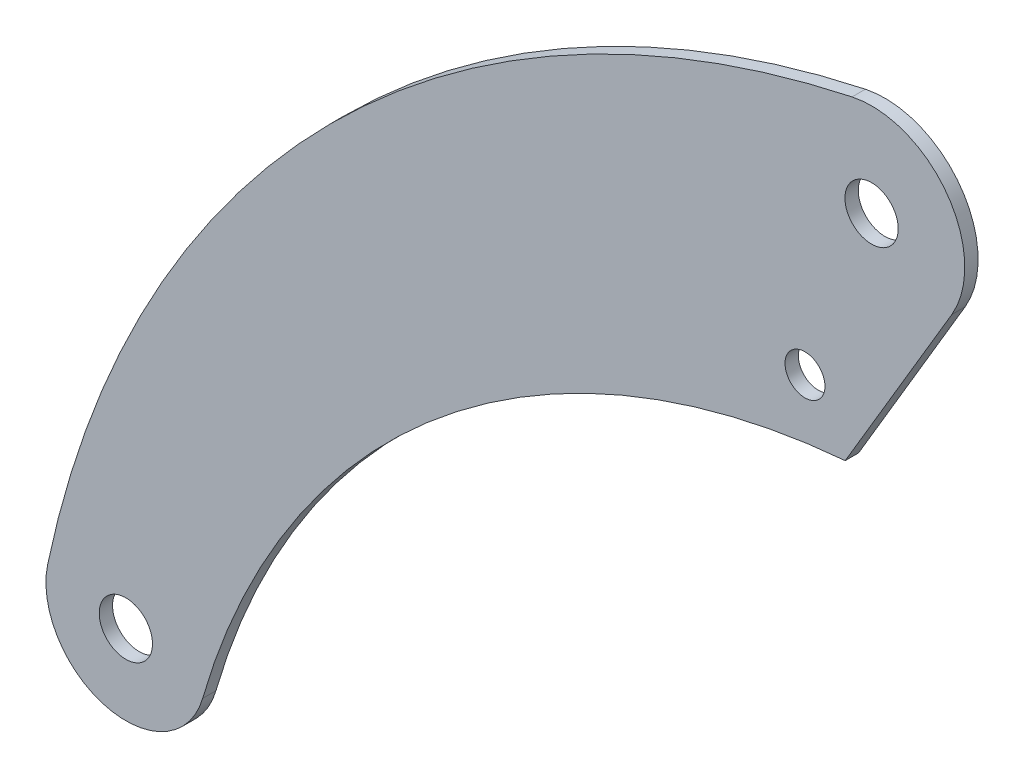
ISO-10303-21;
HEADER;
FILE_DESCRIPTION(('STEP AP214'),'2;1');
FILE_NAME('part.step','',(''),(''),'','','');
FILE_SCHEMA(('AUTOMOTIVE_DESIGN { 1 0 10303 214 1 1 1 1 }'));
ENDSEC;
DATA;
#1=APPLICATION_CONTEXT('core data for automotive mechanical design processes');
#2=APPLICATION_PROTOCOL_DEFINITION('international standard','automotive_design',2000,#1);
#3=PRODUCT_CONTEXT('',#1,'mechanical');
#4=PRODUCT('Part','Part','',(#3));
#5=PRODUCT_RELATED_PRODUCT_CATEGORY('part','',(#4));
#6=PRODUCT_DEFINITION_FORMATION('','',#4);
#7=PRODUCT_DEFINITION_CONTEXT('part definition',#1,'design');
#8=PRODUCT_DEFINITION('design','',#6,#7);
#9=PRODUCT_DEFINITION_SHAPE('','',#8);
#10=(LENGTH_UNIT() NAMED_UNIT(*) SI_UNIT(.MILLI.,.METRE.));
#11=(NAMED_UNIT(*) PLANE_ANGLE_UNIT() SI_UNIT($,.RADIAN.));
#12=(NAMED_UNIT(*) SI_UNIT($,.STERADIAN.) SOLID_ANGLE_UNIT());
#13=UNCERTAINTY_MEASURE_WITH_UNIT(LENGTH_MEASURE(1.E-05),#10,'distance_accuracy_value','');
#14=(GEOMETRIC_REPRESENTATION_CONTEXT(3) GLOBAL_UNCERTAINTY_ASSIGNED_CONTEXT((#13)) GLOBAL_UNIT_ASSIGNED_CONTEXT((#10,
#11,#12)) REPRESENTATION_CONTEXT('',''));
#15=CARTESIAN_POINT('',(0.,0.,0.));
#16=DIRECTION('',(0.,0.,1.));
#17=DIRECTION('',(1.,0.,0.));
#18=AXIS2_PLACEMENT_3D('',#15,#16,#17);
#19=CARTESIAN_POINT('',(586.190673339615,-168.761649937565,5.));
#20=DIRECTION('',(0.,0.,1.));
#21=DIRECTION('',(1.,0.,0.));
#22=AXIS2_PLACEMENT_3D('',#19,#20,#21);
#23=PLANE('',#22);
#24=CARTESIAN_POINT('',(560.,550.,5.));
#25=DIRECTION('',(0.,0.,1.));
#26=DIRECTION('',(1.,0.,0.));
#27=AXIS2_PLACEMENT_3D('',#24,#25,#26);
#28=CIRCLE('',#27,20.);
#29=CARTESIAN_POINT('',(580.,550.,5.));
#30=VERTEX_POINT('',#29);
#31=EDGE_CURVE('E190',#30,#30,#28,.T.);
#32=ORIENTED_EDGE('',*,*,#31,.F.);
#33=EDGE_LOOP('',(#32));
#34=FACE_BOUND('',#33,.T.);
#35=CARTESIAN_POINT('',(586.190673339615,-168.761649937565,5.));
#36=DIRECTION('',(0.,0.,-1.));
#37=DIRECTION('',(1.,0.,0.));
#38=AXIS2_PLACEMENT_3D('',#35,#36,#37);
#39=CIRCLE('',#38,550.);
#40=CARTESIAN_POINT('',(57.6580990170113,-16.5995065512359,5.));
#41=VERTEX_POINT('',#40);
#42=CARTESIAN_POINT('',(540.220407354392,379.313832678879,5.));
#43=VERTEX_POINT('',#42);
#44=EDGE_CURVE('E135',#41,#43,#39,.T.);
#45=ORIENTED_EDGE('',*,*,#44,.T.);
#46=DIRECTION('',(0.509802390301732,0.860291533634175,0.));
#47=VECTOR('',#46,1.);
#48=CARTESIAN_POINT('',(620.220407354392,514.313832678879,5.));
#49=LINE('',#48,#47);
#50=CARTESIAN_POINT('',(620.220407354392,514.313832678879,5.));
#51=VERTEX_POINT('',#50);
#52=EDGE_CURVE('E93',#43,#51,#49,.T.);
#53=ORIENTED_EDGE('',*,*,#52,.T.);
#54=CARTESIAN_POINT('',(560.,550.,5.));
#55=DIRECTION('',(0.,0.,1.));
#56=DIRECTION('',(1.,0.,0.));
#57=AXIS2_PLACEMENT_3D('',#54,#55,#56);
#58=CIRCLE('',#57,70.);
#59=CARTESIAN_POINT('',(545.365415929318,618.453114969869,5.));
#60=VERTEX_POINT('',#59);
#61=EDGE_CURVE('E97',#51,#60,#58,.T.);
#62=ORIENTED_EDGE('',*,*,#61,.T.);
#63=CARTESIAN_POINT('',(709.481823007681,-149.199674335093,5.));
#64=DIRECTION('',(0.,0.,1.));
#65=DIRECTION('',(1.,0.,0.));
#66=AXIS2_PLACEMENT_3D('',#63,#64,#65);
#67=CIRCLE('',#66,785.);
#68=CARTESIAN_POINT('',(-58.7157370764977,12.3475592553181,5.));
#69=VERTEX_POINT('',#68);
#70=EDGE_CURVE('E101',#60,#69,#67,.T.);
#71=ORIENTED_EDGE('',*,*,#70,.T.);
#72=CARTESIAN_POINT('',(0.,0.,5.));
#73=DIRECTION('',(0.,0.,1.));
#74=DIRECTION('',(-1.,0.,0.));
#75=AXIS2_PLACEMENT_3D('',#72,#73,#74);
#76=CIRCLE('',#75,60.);
#77=EDGE_CURVE('E59',#69,#41,#76,.T.);
#78=ORIENTED_EDGE('',*,*,#77,.T.);
#79=EDGE_LOOP('',(#45,#53,#62,#71,#78));
#80=FACE_BOUND('',#79,.T.);
#81=CARTESIAN_POINT('',(0.,0.,5.));
#82=DIRECTION('',(0.,0.,1.));
#83=DIRECTION('',(1.,0.,0.));
#84=AXIS2_PLACEMENT_3D('',#81,#82,#83);
#85=CIRCLE('',#84,20.);
#86=CARTESIAN_POINT('',(20.,0.,5.));
#87=VERTEX_POINT('',#86);
#88=EDGE_CURVE('E126',#87,#87,#85,.T.);
#89=ORIENTED_EDGE('',*,*,#88,.F.);
#90=EDGE_LOOP('',(#89));
#91=FACE_BOUND('',#90,.T.);
#92=CARTESIAN_POINT('',(510.,420.,5.));
#93=DIRECTION('',(0.,0.,1.));
#94=DIRECTION('',(1.,0.,0.));
#95=AXIS2_PLACEMENT_3D('',#92,#93,#94);
#96=CIRCLE('',#95,15.);
#97=CARTESIAN_POINT('',(525.,420.,5.));
#98=VERTEX_POINT('',#97);
#99=EDGE_CURVE('E179',#98,#98,#96,.T.);
#100=ORIENTED_EDGE('',*,*,#99,.F.);
#101=EDGE_LOOP('',(#100));
#102=FACE_BOUND('',#101,.T.);
#103=ADVANCED_FACE('F41',(#34,#80,#91,#102),#23,.T.);
#104=CARTESIAN_POINT('',(586.190673339615,-168.761649937565,-5.));
#105=DIRECTION('',(0.,0.,1.));
#106=DIRECTION('',(1.,0.,0.));
#107=AXIS2_PLACEMENT_3D('',#104,#105,#106);
#108=PLANE('',#107);
#109=CARTESIAN_POINT('',(586.190673339615,-168.761649937565,-5.));
#110=DIRECTION('',(0.,0.,-1.));
#111=DIRECTION('',(1.,0.,0.));
#112=AXIS2_PLACEMENT_3D('',#109,#110,#111);
#113=CIRCLE('',#112,550.);
#114=CARTESIAN_POINT('',(57.6580990170113,-16.5995065512359,-5.));
#115=VERTEX_POINT('',#114);
#116=CARTESIAN_POINT('',(540.220407354392,379.313832678879,-5.));
#117=VERTEX_POINT('',#116);
#118=EDGE_CURVE('E121',#115,#117,#113,.T.);
#119=ORIENTED_EDGE('',*,*,#118,.F.);
#120=CARTESIAN_POINT('',(0.,0.,-5.));
#121=DIRECTION('',(0.,0.,1.));
#122=DIRECTION('',(-1.,0.,0.));
#123=AXIS2_PLACEMENT_3D('',#120,#121,#122);
#124=CIRCLE('',#123,60.);
#125=CARTESIAN_POINT('',(-58.7157370764977,12.3475592553181,-5.));
#126=VERTEX_POINT('',#125);
#127=EDGE_CURVE('E85',#126,#115,#124,.T.);
#128=ORIENTED_EDGE('',*,*,#127,.F.);
#129=CARTESIAN_POINT('',(709.481823007681,-149.199674335093,-5.));
#130=DIRECTION('',(0.,0.,1.));
#131=DIRECTION('',(1.,0.,0.));
#132=AXIS2_PLACEMENT_3D('',#129,#130,#131);
#133=CIRCLE('',#132,785.);
#134=CARTESIAN_POINT('',(545.365415929318,618.453114969869,-5.));
#135=VERTEX_POINT('',#134);
#136=EDGE_CURVE('E79',#135,#126,#133,.T.);
#137=ORIENTED_EDGE('',*,*,#136,.F.);
#138=CARTESIAN_POINT('',(560.,550.,-5.));
#139=DIRECTION('',(0.,0.,1.));
#140=DIRECTION('',(1.,0.,0.));
#141=AXIS2_PLACEMENT_3D('',#138,#139,#140);
#142=CIRCLE('',#141,70.);
#143=CARTESIAN_POINT('',(620.220407354392,514.313832678879,-5.));
#144=VERTEX_POINT('',#143);
#145=EDGE_CURVE('E109',#144,#135,#142,.T.);
#146=ORIENTED_EDGE('',*,*,#145,.F.);
#147=DIRECTION('',(0.509802390301732,0.860291533634175,0.));
#148=VECTOR('',#147,1.);
#149=CARTESIAN_POINT('',(620.220407354392,514.313832678879,-5.));
#150=LINE('',#149,#148);
#151=EDGE_CURVE('E125',#117,#144,#150,.T.);
#152=ORIENTED_EDGE('',*,*,#151,.F.);
#153=EDGE_LOOP('',(#119,#128,#137,#146,#152));
#154=FACE_BOUND('',#153,.T.);
#155=CARTESIAN_POINT('',(0.,0.,-5.));
#156=DIRECTION('',(0.,0.,1.));
#157=DIRECTION('',(1.,0.,0.));
#158=AXIS2_PLACEMENT_3D('',#155,#156,#157);
#159=CIRCLE('',#158,20.);
#160=CARTESIAN_POINT('',(20.,0.,-5.));
#161=VERTEX_POINT('',#160);
#162=EDGE_CURVE('E194',#161,#161,#159,.T.);
#163=ORIENTED_EDGE('',*,*,#162,.T.);
#164=EDGE_LOOP('',(#163));
#165=FACE_BOUND('',#164,.T.);
#166=CARTESIAN_POINT('',(560.,550.,-5.));
#167=DIRECTION('',(0.,0.,1.));
#168=DIRECTION('',(1.,0.,0.));
#169=AXIS2_PLACEMENT_3D('',#166,#167,#168);
#170=CIRCLE('',#169,20.);
#171=CARTESIAN_POINT('',(580.,550.,-5.));
#172=VERTEX_POINT('',#171);
#173=EDGE_CURVE('E187',#172,#172,#170,.T.);
#174=ORIENTED_EDGE('',*,*,#173,.T.);
#175=EDGE_LOOP('',(#174));
#176=FACE_BOUND('',#175,.T.);
#177=CARTESIAN_POINT('',(510.,420.,-5.));
#178=DIRECTION('',(0.,0.,1.));
#179=DIRECTION('',(1.,0.,0.));
#180=AXIS2_PLACEMENT_3D('',#177,#178,#179);
#181=CIRCLE('',#180,15.);
#182=CARTESIAN_POINT('',(525.,420.,-5.));
#183=VERTEX_POINT('',#182);
#184=EDGE_CURVE('E182',#183,#183,#181,.T.);
#185=ORIENTED_EDGE('',*,*,#184,.T.);
#186=EDGE_LOOP('',(#185));
#187=FACE_BOUND('',#186,.T.);
#188=ADVANCED_FACE('F142',(#154,#165,#176,#187),#108,.F.);
#189=CARTESIAN_POINT('',(586.190673339615,-168.761649937565,5.));
#190=DIRECTION('',(0.,0.,-1.));
#191=DIRECTION('',(-1.,0.,0.));
#192=AXIS2_PLACEMENT_3D('',#189,#190,#191);
#193=CYLINDRICAL_SURFACE('',#192,550.);
#194=ORIENTED_EDGE('',*,*,#118,.T.);
#195=DIRECTION('',(0.,0.,-1.));
#196=VECTOR('',#195,1.);
#197=CARTESIAN_POINT('',(540.220407354392,379.313832678879,5.));
#198=LINE('',#197,#196);
#199=EDGE_CURVE('E11',#43,#117,#198,.T.);
#200=ORIENTED_EDGE('',*,*,#199,.F.);
#201=ORIENTED_EDGE('',*,*,#44,.F.);
#202=DIRECTION('',(0.,0.,-1.));
#203=VECTOR('',#202,1.);
#204=CARTESIAN_POINT('',(57.6580990170113,-16.5995065512359,5.));
#205=LINE('',#204,#203);
#206=EDGE_CURVE('E117',#41,#115,#205,.T.);
#207=ORIENTED_EDGE('',*,*,#206,.T.);
#208=EDGE_LOOP('',(#194,#200,#201,#207));
#209=FACE_BOUND('',#208,.T.);
#210=ADVANCED_FACE('F43',(#209),#193,.F.);
#211=CARTESIAN_POINT('',(620.220407354392,514.313832678879,5.));
#212=DIRECTION('',(-0.860291533634175,0.509802390301732,0.));
#213=DIRECTION('',(-0.509802390301732,-0.860291533634175,0.));
#214=AXIS2_PLACEMENT_3D('',#211,#212,#213);
#215=PLANE('',#214);
#216=ORIENTED_EDGE('',*,*,#151,.T.);
#217=DIRECTION('',(0.,0.,-1.));
#218=VECTOR('',#217,1.);
#219=CARTESIAN_POINT('',(620.220407354392,514.313832678879,5.));
#220=LINE('',#219,#218);
#221=EDGE_CURVE('E51',#51,#144,#220,.T.);
#222=ORIENTED_EDGE('',*,*,#221,.F.);
#223=ORIENTED_EDGE('',*,*,#52,.F.);
#224=ORIENTED_EDGE('',*,*,#199,.T.);
#225=EDGE_LOOP('',(#216,#222,#223,#224));
#226=FACE_BOUND('',#225,.T.);
#227=ADVANCED_FACE('F240',(#226),#215,.F.);
#228=CARTESIAN_POINT('',(560.,550.,5.));
#229=DIRECTION('',(0.,0.,-1.));
#230=DIRECTION('',(-1.,0.,0.));
#231=AXIS2_PLACEMENT_3D('',#228,#229,#230);
#232=CYLINDRICAL_SURFACE('',#231,70.);
#233=ORIENTED_EDGE('',*,*,#145,.T.);
#234=DIRECTION('',(0.,0.,-1.));
#235=VECTOR('',#234,1.);
#236=CARTESIAN_POINT('',(545.365415929318,618.453114969869,5.));
#237=LINE('',#236,#235);
#238=EDGE_CURVE('E106',#60,#135,#237,.T.);
#239=ORIENTED_EDGE('',*,*,#238,.F.);
#240=ORIENTED_EDGE('',*,*,#61,.F.);
#241=ORIENTED_EDGE('',*,*,#221,.T.);
#242=EDGE_LOOP('',(#233,#239,#240,#241));
#243=FACE_BOUND('',#242,.T.);
#244=ADVANCED_FACE('F107',(#243),#232,.T.);
#245=CARTESIAN_POINT('',(709.481823007681,-149.199674335093,5.));
#246=DIRECTION('',(0.,0.,-1.));
#247=DIRECTION('',(-1.,0.,0.));
#248=AXIS2_PLACEMENT_3D('',#245,#246,#247);
#249=CYLINDRICAL_SURFACE('',#248,785.);
#250=ORIENTED_EDGE('',*,*,#136,.T.);
#251=DIRECTION('',(0.,0.,-1.));
#252=VECTOR('',#251,1.);
#253=CARTESIAN_POINT('',(-58.7157370764977,12.3475592553181,5.));
#254=LINE('',#253,#252);
#255=EDGE_CURVE('E111',#69,#126,#254,.T.);
#256=ORIENTED_EDGE('',*,*,#255,.F.);
#257=ORIENTED_EDGE('',*,*,#70,.F.);
#258=ORIENTED_EDGE('',*,*,#238,.T.);
#259=EDGE_LOOP('',(#250,#256,#257,#258));
#260=FACE_BOUND('',#259,.T.);
#261=ADVANCED_FACE('F113',(#260),#249,.T.);
#262=CARTESIAN_POINT('',(0.,0.,5.));
#263=DIRECTION('',(0.,0.,-1.));
#264=DIRECTION('',(-1.,0.,0.));
#265=AXIS2_PLACEMENT_3D('',#262,#263,#264);
#266=CYLINDRICAL_SURFACE('',#265,60.);
#267=ORIENTED_EDGE('',*,*,#127,.T.);
#268=ORIENTED_EDGE('',*,*,#206,.F.);
#269=ORIENTED_EDGE('',*,*,#77,.F.);
#270=ORIENTED_EDGE('',*,*,#255,.T.);
#271=EDGE_LOOP('',(#267,#268,#269,#270));
#272=FACE_BOUND('',#271,.T.);
#273=ADVANCED_FACE('F147',(#272),#266,.T.);
#274=CARTESIAN_POINT('',(0.,0.,5.));
#275=DIRECTION('',(0.,0.,-1.));
#276=DIRECTION('',(-1.,0.,0.));
#277=AXIS2_PLACEMENT_3D('',#274,#275,#276);
#278=CYLINDRICAL_SURFACE('',#277,20.);
#279=ORIENTED_EDGE('',*,*,#88,.T.);
#280=EDGE_LOOP('',(#279));
#281=FACE_BOUND('',#280,.T.);
#282=ORIENTED_EDGE('',*,*,#162,.F.);
#283=EDGE_LOOP('',(#282));
#284=FACE_BOUND('',#283,.T.);
#285=ADVANCED_FACE('F149',(#281,#284),#278,.F.);
#286=CARTESIAN_POINT('',(560.,550.,5.));
#287=DIRECTION('',(0.,0.,-1.));
#288=DIRECTION('',(-1.,0.,0.));
#289=AXIS2_PLACEMENT_3D('',#286,#287,#288);
#290=CYLINDRICAL_SURFACE('',#289,20.);
#291=ORIENTED_EDGE('',*,*,#31,.T.);
#292=EDGE_LOOP('',(#291));
#293=FACE_BOUND('',#292,.T.);
#294=ORIENTED_EDGE('',*,*,#173,.F.);
#295=EDGE_LOOP('',(#294));
#296=FACE_BOUND('',#295,.T.);
#297=ADVANCED_FACE('F155',(#293,#296),#290,.F.);
#298=CARTESIAN_POINT('',(510.,420.,5.));
#299=DIRECTION('',(0.,0.,-1.));
#300=DIRECTION('',(-1.,0.,0.));
#301=AXIS2_PLACEMENT_3D('',#298,#299,#300);
#302=CYLINDRICAL_SURFACE('',#301,15.);
#303=ORIENTED_EDGE('',*,*,#99,.T.);
#304=EDGE_LOOP('',(#303));
#305=FACE_BOUND('',#304,.T.);
#306=ORIENTED_EDGE('',*,*,#184,.F.);
#307=EDGE_LOOP('',(#306));
#308=FACE_BOUND('',#307,.T.);
#309=ADVANCED_FACE('F170',(#305,#308),#302,.F.);
#310=CLOSED_SHELL('',(#103,#188,#210,#227,#244,#261,#273,#285,#297,#309));
#311=MANIFOLD_SOLID_BREP('B2',#310);
#312=ADVANCED_BREP_SHAPE_REPRESENTATION('',(#18,#311),#14);
#313=SHAPE_DEFINITION_REPRESENTATION(#9,#312);
ENDSEC;
END-ISO-10303-21;
